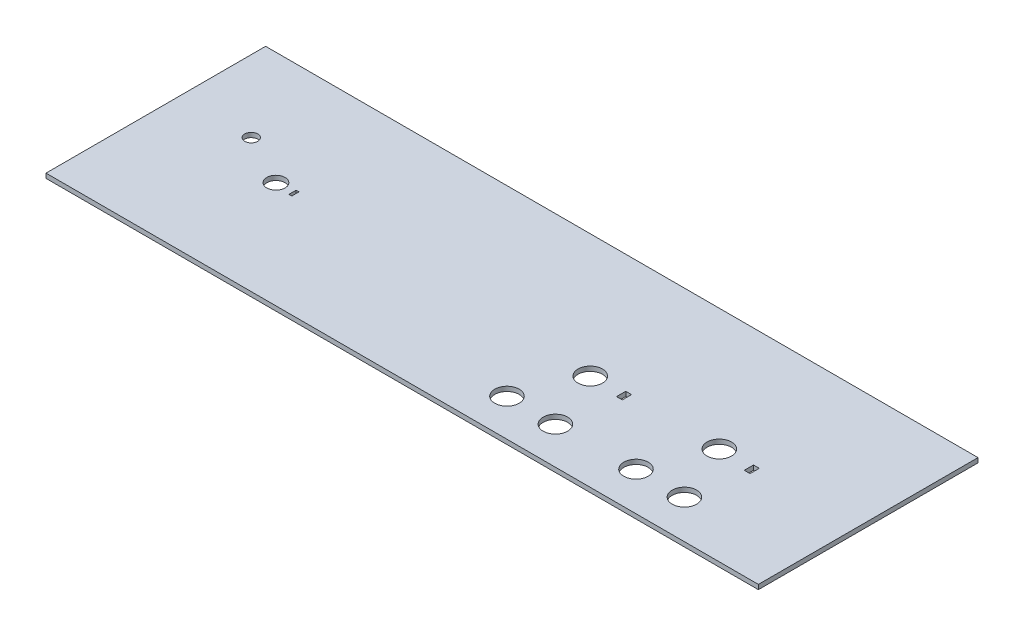
ISO-10303-21;
HEADER;
FILE_DESCRIPTION(('STEP AP214'),'2;1');
FILE_NAME('part.step','',(''),(''),'','','');
FILE_SCHEMA(('AUTOMOTIVE_DESIGN { 1 0 10303 214 1 1 1 1 }'));
ENDSEC;
DATA;
#1=APPLICATION_CONTEXT('core data for automotive mechanical design processes');
#2=APPLICATION_PROTOCOL_DEFINITION('international standard','automotive_design',2000,#1);
#3=PRODUCT_CONTEXT('',#1,'mechanical');
#4=PRODUCT('Part','Part','',(#3));
#5=PRODUCT_RELATED_PRODUCT_CATEGORY('part','',(#4));
#6=PRODUCT_DEFINITION_FORMATION('','',#4);
#7=PRODUCT_DEFINITION_CONTEXT('part definition',#1,'design');
#8=PRODUCT_DEFINITION('design','',#6,#7);
#9=PRODUCT_DEFINITION_SHAPE('','',#8);
#10=(LENGTH_UNIT() NAMED_UNIT(*) SI_UNIT(.MILLI.,.METRE.));
#11=(NAMED_UNIT(*) PLANE_ANGLE_UNIT() SI_UNIT($,.RADIAN.));
#12=(NAMED_UNIT(*) SI_UNIT($,.STERADIAN.) SOLID_ANGLE_UNIT());
#13=UNCERTAINTY_MEASURE_WITH_UNIT(LENGTH_MEASURE(1.E-05),#10,'distance_accuracy_value','');
#14=(GEOMETRIC_REPRESENTATION_CONTEXT(3) GLOBAL_UNCERTAINTY_ASSIGNED_CONTEXT((#13)) GLOBAL_UNIT_ASSIGNED_CONTEXT((#10,
#11,#12)) REPRESENTATION_CONTEXT('',''));
#15=CARTESIAN_POINT('',(0.,0.,0.));
#16=DIRECTION('',(0.,0.,1.));
#17=DIRECTION('',(1.,0.,0.));
#18=AXIS2_PLACEMENT_3D('',#15,#16,#17);
#19=CARTESIAN_POINT('',(0.,1.6,0.));
#20=DIRECTION('',(0.,-1.,0.));
#21=DIRECTION('',(0.,0.,-1.));
#22=AXIS2_PLACEMENT_3D('',#19,#20,#21);
#23=PLANE('',#22);
#24=CARTESIAN_POINT('',(42.8531598360651,1.6,-37.0757650903164));
#25=DIRECTION('',(0.,1.,0.));
#26=DIRECTION('',(0.,0.,1.));
#27=AXIS2_PLACEMENT_3D('',#24,#25,#26);
#28=CIRCLE('',#27,3.175);
#29=CARTESIAN_POINT('',(42.8531598360651,1.6,-33.9007650903164));
#30=VERTEX_POINT('',#29);
#31=EDGE_CURVE('E182',#30,#30,#28,.T.);
#32=ORIENTED_EDGE('',*,*,#31,.F.);
#33=EDGE_LOOP('',(#32));
#34=FACE_BOUND('',#33,.T.);
#35=DIRECTION('',(0.,0.,-1.));
#36=VECTOR('',#35,1.);
#37=CARTESIAN_POINT('',(168.455253876297,1.6,-31.8967419398398));
#38=LINE('',#37,#36);
#39=CARTESIAN_POINT('',(168.455253876297,1.6,-31.8967419398398));
#40=VERTEX_POINT('',#39);
#41=CARTESIAN_POINT('',(168.455253876297,1.6,-35.0967419398398));
#42=VERTEX_POINT('',#41);
#43=EDGE_CURVE('E194',#40,#42,#38,.T.);
#44=ORIENTED_EDGE('',*,*,#43,.F.);
#45=DIRECTION('',(1.,0.,0.));
#46=VECTOR('',#45,1.);
#47=CARTESIAN_POINT('',(166.455253876297,1.6,-31.8967419398398));
#48=LINE('',#47,#46);
#49=CARTESIAN_POINT('',(166.455253876297,1.6,-31.8967419398398));
#50=VERTEX_POINT('',#49);
#51=EDGE_CURVE('E202',#50,#40,#48,.T.);
#52=ORIENTED_EDGE('',*,*,#51,.F.);
#53=DIRECTION('',(0.,0.,1.));
#54=VECTOR('',#53,1.);
#55=CARTESIAN_POINT('',(166.455253876297,1.6,-31.8967419398398));
#56=LINE('',#55,#54);
#57=CARTESIAN_POINT('',(166.455253876297,1.6,-35.0967419398398));
#58=VERTEX_POINT('',#57);
#59=EDGE_CURVE('E199',#58,#50,#56,.T.);
#60=ORIENTED_EDGE('',*,*,#59,.F.);
#61=DIRECTION('',(-1.,0.,0.));
#62=VECTOR('',#61,1.);
#63=CARTESIAN_POINT('',(166.455253876297,1.6,-35.0967419398398));
#64=LINE('',#63,#62);
#65=EDGE_CURVE('E196',#42,#58,#64,.T.);
#66=ORIENTED_EDGE('',*,*,#65,.F.);
#67=EDGE_LOOP('',(#44,#52,#60,#66));
#68=FACE_BOUND('',#67,.T.);
#69=CARTESIAN_POINT('',(155.705253876297,1.6,-33.4967419398398));
#70=DIRECTION('',(0.,1.,0.));
#71=DIRECTION('',(0.,0.,1.));
#72=AXIS2_PLACEMENT_3D('',#69,#70,#71);
#73=CIRCLE('',#72,4.25000000000001);
#74=CARTESIAN_POINT('',(155.705253876297,1.6,-29.2467419398398));
#75=VERTEX_POINT('',#74);
#76=EDGE_CURVE('E256',#75,#75,#73,.T.);
#77=ORIENTED_EDGE('',*,*,#76,.F.);
#78=EDGE_LOOP('',(#77));
#79=FACE_BOUND('',#78,.T.);
#80=CARTESIAN_POINT('',(147.291503876297,1.6,-12.9682474610587));
#81=DIRECTION('',(0.,1.,0.));
#82=DIRECTION('',(0.,0.,1.));
#83=AXIS2_PLACEMENT_3D('',#80,#81,#82);
#84=CIRCLE('',#83,4.25000000000001);
#85=CARTESIAN_POINT('',(147.291503876297,1.6,-8.71824746105873));
#86=VERTEX_POINT('',#85);
#87=EDGE_CURVE('E268',#86,#86,#84,.T.);
#88=ORIENTED_EDGE('',*,*,#87,.F.);
#89=EDGE_LOOP('',(#88));
#90=FACE_BOUND('',#89,.T.);
#91=CARTESIAN_POINT('',(191.691308657808,1.6,-13.4166431342976));
#92=DIRECTION('',(0.,1.,0.));
#93=DIRECTION('',(0.,0.,1.));
#94=AXIS2_PLACEMENT_3D('',#91,#92,#93);
#95=CIRCLE('',#94,4.25000000000001);
#96=CARTESIAN_POINT('',(191.691308657808,1.6,-9.16664313429763));
#97=VERTEX_POINT('',#96);
#98=EDGE_CURVE('E280',#97,#97,#95,.T.);
#99=ORIENTED_EDGE('',*,*,#98,.F.);
#100=EDGE_LOOP('',(#99));
#101=FACE_BOUND('',#100,.T.);
#102=DIRECTION('',(0.,0.,1.));
#103=VECTOR('',#102,1.);
#104=CARTESIAN_POINT('',(0.,1.6,0.));
#105=LINE('',#104,#103);
#106=CARTESIAN_POINT('',(0.,1.6,-76.3524));
#107=VERTEX_POINT('',#106);
#108=CARTESIAN_POINT('',(0.,1.6,0.));
#109=VERTEX_POINT('',#108);
#110=EDGE_CURVE('E292',#107,#109,#105,.T.);
#111=ORIENTED_EDGE('',*,*,#110,.T.);
#112=DIRECTION('',(1.,0.,0.));
#113=VECTOR('',#112,1.);
#114=CARTESIAN_POINT('',(0.,1.6,0.));
#115=LINE('',#114,#113);
#116=CARTESIAN_POINT('',(247.65,1.6,0.));
#117=VERTEX_POINT('',#116);
#118=EDGE_CURVE('E295',#109,#117,#115,.T.);
#119=ORIENTED_EDGE('',*,*,#118,.T.);
#120=DIRECTION('',(0.,0.,-1.));
#121=VECTOR('',#120,1.);
#122=CARTESIAN_POINT('',(247.65,1.6,0.));
#123=LINE('',#122,#121);
#124=CARTESIAN_POINT('',(247.65,1.6,-76.3524));
#125=VERTEX_POINT('',#124);
#126=EDGE_CURVE('E298',#117,#125,#123,.T.);
#127=ORIENTED_EDGE('',*,*,#126,.T.);
#128=DIRECTION('',(-1.,0.,0.));
#129=VECTOR('',#128,1.);
#130=CARTESIAN_POINT('',(0.,1.6,-76.3524));
#131=LINE('',#130,#129);
#132=EDGE_CURVE('E300',#125,#107,#131,.T.);
#133=ORIENTED_EDGE('',*,*,#132,.T.);
#134=EDGE_LOOP('',(#111,#119,#127,#133));
#135=FACE_BOUND('',#134,.T.);
#136=CARTESIAN_POINT('',(208.518808657808,1.6,-13.4166431342976));
#137=DIRECTION('',(0.,1.,0.));
#138=DIRECTION('',(0.,0.,1.));
#139=AXIS2_PLACEMENT_3D('',#136,#137,#138);
#140=CIRCLE('',#139,4.25000000000001);
#141=CARTESIAN_POINT('',(208.518808657808,1.6,-9.16664313429763));
#142=VERTEX_POINT('',#141);
#143=EDGE_CURVE('E286',#142,#142,#140,.T.);
#144=ORIENTED_EDGE('',*,*,#143,.F.);
#145=EDGE_LOOP('',(#144));
#146=FACE_BOUND('',#145,.T.);
#147=CARTESIAN_POINT('',(164.119003876297,1.6,-12.9682474610587));
#148=DIRECTION('',(0.,1.,0.));
#149=DIRECTION('',(0.,0.,1.));
#150=AXIS2_PLACEMENT_3D('',#147,#148,#149);
#151=CIRCLE('',#150,4.25000000000001);
#152=CARTESIAN_POINT('',(164.119003876297,1.6,-8.71824746105873));
#153=VERTEX_POINT('',#152);
#154=EDGE_CURVE('E274',#153,#153,#151,.T.);
#155=ORIENTED_EDGE('',*,*,#154,.F.);
#156=EDGE_LOOP('',(#155));
#157=FACE_BOUND('',#156,.T.);
#158=CARTESIAN_POINT('',(200.105058657808,1.6,-33.9632743694735));
#159=DIRECTION('',(0.,1.,0.));
#160=DIRECTION('',(0.,0.,1.));
#161=AXIS2_PLACEMENT_3D('',#158,#159,#160);
#162=CIRCLE('',#161,4.25000000000001);
#163=CARTESIAN_POINT('',(200.105058657808,1.6,-29.7132743694734));
#164=VERTEX_POINT('',#163);
#165=EDGE_CURVE('E262',#164,#164,#162,.T.);
#166=ORIENTED_EDGE('',*,*,#165,.F.);
#167=EDGE_LOOP('',(#166));
#168=FACE_BOUND('',#167,.T.);
#169=DIRECTION('',(0.,0.,-1.));
#170=VECTOR('',#169,1.);
#171=CARTESIAN_POINT('',(212.855058657808,1.6,-31.8967419398398));
#172=LINE('',#171,#170);
#173=CARTESIAN_POINT('',(212.855058657808,1.6,-31.8967419398398));
#174=VERTEX_POINT('',#173);
#175=CARTESIAN_POINT('',(212.855058657808,1.6,-35.0967419398398));
#176=VERTEX_POINT('',#175);
#177=EDGE_CURVE('E225',#174,#176,#172,.T.);
#178=ORIENTED_EDGE('',*,*,#177,.F.);
#179=DIRECTION('',(1.,0.,0.));
#180=VECTOR('',#179,1.);
#181=CARTESIAN_POINT('',(210.855058657808,1.6,-31.8967419398398));
#182=LINE('',#181,#180);
#183=CARTESIAN_POINT('',(210.855058657808,1.6,-31.8967419398398));
#184=VERTEX_POINT('',#183);
#185=EDGE_CURVE('E233',#184,#174,#182,.T.);
#186=ORIENTED_EDGE('',*,*,#185,.F.);
#187=DIRECTION('',(0.,0.,1.));
#188=VECTOR('',#187,1.);
#189=CARTESIAN_POINT('',(210.855058657808,1.6,-31.8967419398398));
#190=LINE('',#189,#188);
#191=CARTESIAN_POINT('',(210.855058657808,1.6,-35.0967419398398));
#192=VERTEX_POINT('',#191);
#193=EDGE_CURVE('E230',#192,#184,#190,.T.);
#194=ORIENTED_EDGE('',*,*,#193,.F.);
#195=DIRECTION('',(-1.,0.,0.));
#196=VECTOR('',#195,1.);
#197=CARTESIAN_POINT('',(210.855058657808,1.6,-35.0967419398398));
#198=LINE('',#197,#196);
#199=EDGE_CURVE('E227',#176,#192,#198,.T.);
#200=ORIENTED_EDGE('',*,*,#199,.F.);
#201=EDGE_LOOP('',(#178,#186,#194,#200));
#202=FACE_BOUND('',#201,.T.);
#203=CARTESIAN_POINT('',(25.,1.6,-46.3524));
#204=DIRECTION('',(0.,1.,0.));
#205=DIRECTION('',(0.,0.,1.));
#206=AXIS2_PLACEMENT_3D('',#203,#204,#205);
#207=CIRCLE('',#206,2.25);
#208=CARTESIAN_POINT('',(25.,1.6,-44.1024));
#209=VERTEX_POINT('',#208);
#210=EDGE_CURVE('E188',#209,#209,#207,.T.);
#211=ORIENTED_EDGE('',*,*,#210,.F.);
#212=EDGE_LOOP('',(#211));
#213=FACE_BOUND('',#212,.T.);
#214=DIRECTION('',(0.,0.,-1.));
#215=VECTOR('',#214,1.);
#216=CARTESIAN_POINT('',(49.6281598360651,1.6,-35.8257650903164));
#217=LINE('',#216,#215);
#218=CARTESIAN_POINT('',(49.6281598360651,1.6,-35.8257650903164));
#219=VERTEX_POINT('',#218);
#220=CARTESIAN_POINT('',(49.6281598360651,1.6,-38.3257650903164));
#221=VERTEX_POINT('',#220);
#222=EDGE_CURVE('E146',#219,#221,#217,.T.);
#223=ORIENTED_EDGE('',*,*,#222,.F.);
#224=DIRECTION('',(1.,0.,0.));
#225=VECTOR('',#224,1.);
#226=CARTESIAN_POINT('',(48.6281598360651,1.6,-35.8257650903164));
#227=LINE('',#226,#225);
#228=CARTESIAN_POINT('',(48.6281598360651,1.6,-35.8257650903164));
#229=VERTEX_POINT('',#228);
#230=EDGE_CURVE('E168',#229,#219,#227,.T.);
#231=ORIENTED_EDGE('',*,*,#230,.F.);
#232=DIRECTION('',(0.,0.,1.));
#233=VECTOR('',#232,1.);
#234=CARTESIAN_POINT('',(48.6281598360651,1.6,-35.8257650903164));
#235=LINE('',#234,#233);
#236=CARTESIAN_POINT('',(48.6281598360651,1.6,-38.3257650903164));
#237=VERTEX_POINT('',#236);
#238=EDGE_CURVE('E166',#237,#229,#235,.T.);
#239=ORIENTED_EDGE('',*,*,#238,.F.);
#240=DIRECTION('',(-1.,0.,0.));
#241=VECTOR('',#240,1.);
#242=CARTESIAN_POINT('',(48.6281598360651,1.6,-38.3257650903164));
#243=LINE('',#242,#241);
#244=EDGE_CURVE('E154',#221,#237,#243,.T.);
#245=ORIENTED_EDGE('',*,*,#244,.F.);
#246=EDGE_LOOP('',(#223,#231,#239,#245));
#247=FACE_BOUND('',#246,.T.);
#248=ADVANCED_FACE('F33',(#34,#68,#79,#90,#101,#135,#146,#157,#168,#202,#213,#247),#23,.F.);
#249=CARTESIAN_POINT('',(0.,0.,0.));
#250=DIRECTION('',(0.,-1.,0.));
#251=DIRECTION('',(0.,0.,-1.));
#252=AXIS2_PLACEMENT_3D('',#249,#250,#251);
#253=PLANE('',#252);
#254=CARTESIAN_POINT('',(42.8531598360651,0.,-37.0757650903164));
#255=DIRECTION('',(0.,1.,0.));
#256=DIRECTION('',(0.,0.,1.));
#257=AXIS2_PLACEMENT_3D('',#254,#255,#256);
#258=CIRCLE('',#257,3.175);
#259=CARTESIAN_POINT('',(42.8531598360651,0.,-33.9007650903164));
#260=VERTEX_POINT('',#259);
#261=EDGE_CURVE('E162',#260,#260,#258,.T.);
#262=ORIENTED_EDGE('',*,*,#261,.T.);
#263=EDGE_LOOP('',(#262));
#264=FACE_BOUND('',#263,.T.);
#265=DIRECTION('',(1.,0.,0.));
#266=VECTOR('',#265,1.);
#267=CARTESIAN_POINT('',(166.455253876297,0.,-31.8967419398398));
#268=LINE('',#267,#266);
#269=CARTESIAN_POINT('',(166.455253876297,0.,-31.8967419398398));
#270=VERTEX_POINT('',#269);
#271=CARTESIAN_POINT('',(168.455253876297,0.,-31.8967419398398));
#272=VERTEX_POINT('',#271);
#273=EDGE_CURVE('E197',#270,#272,#268,.T.);
#274=ORIENTED_EDGE('',*,*,#273,.T.);
#275=DIRECTION('',(0.,0.,-1.));
#276=VECTOR('',#275,1.);
#277=CARTESIAN_POINT('',(168.455253876297,0.,-31.8967419398398));
#278=LINE('',#277,#276);
#279=CARTESIAN_POINT('',(168.455253876297,0.,-35.0967419398398));
#280=VERTEX_POINT('',#279);
#281=EDGE_CURVE('E191',#272,#280,#278,.T.);
#282=ORIENTED_EDGE('',*,*,#281,.T.);
#283=DIRECTION('',(-1.,0.,0.));
#284=VECTOR('',#283,1.);
#285=CARTESIAN_POINT('',(166.455253876297,0.,-35.0967419398398));
#286=LINE('',#285,#284);
#287=CARTESIAN_POINT('',(166.455253876297,0.,-35.0967419398398));
#288=VERTEX_POINT('',#287);
#289=EDGE_CURVE('E207',#280,#288,#286,.T.);
#290=ORIENTED_EDGE('',*,*,#289,.T.);
#291=DIRECTION('',(0.,0.,1.));
#292=VECTOR('',#291,1.);
#293=CARTESIAN_POINT('',(166.455253876297,0.,-31.8967419398398));
#294=LINE('',#293,#292);
#295=EDGE_CURVE('E210',#288,#270,#294,.T.);
#296=ORIENTED_EDGE('',*,*,#295,.T.);
#297=EDGE_LOOP('',(#274,#282,#290,#296));
#298=FACE_BOUND('',#297,.T.);
#299=CARTESIAN_POINT('',(155.705253876297,0.,-33.4967419398398));
#300=DIRECTION('',(0.,1.,0.));
#301=DIRECTION('',(0.,0.,1.));
#302=AXIS2_PLACEMENT_3D('',#299,#300,#301);
#303=CIRCLE('',#302,4.25000000000001);
#304=CARTESIAN_POINT('',(155.705253876297,0.,-29.2467419398398));
#305=VERTEX_POINT('',#304);
#306=EDGE_CURVE('E255',#305,#305,#303,.T.);
#307=ORIENTED_EDGE('',*,*,#306,.T.);
#308=EDGE_LOOP('',(#307));
#309=FACE_BOUND('',#308,.T.);
#310=CARTESIAN_POINT('',(147.291503876297,0.,-12.9682474610587));
#311=DIRECTION('',(0.,1.,0.));
#312=DIRECTION('',(0.,0.,1.));
#313=AXIS2_PLACEMENT_3D('',#310,#311,#312);
#314=CIRCLE('',#313,4.25000000000001);
#315=CARTESIAN_POINT('',(147.291503876297,0.,-8.71824746105873));
#316=VERTEX_POINT('',#315);
#317=EDGE_CURVE('E265',#316,#316,#314,.T.);
#318=ORIENTED_EDGE('',*,*,#317,.T.);
#319=EDGE_LOOP('',(#318));
#320=FACE_BOUND('',#319,.T.);
#321=CARTESIAN_POINT('',(191.691308657808,0.,-13.4166431342976));
#322=DIRECTION('',(0.,1.,0.));
#323=DIRECTION('',(0.,0.,1.));
#324=AXIS2_PLACEMENT_3D('',#321,#322,#323);
#325=CIRCLE('',#324,4.25000000000001);
#326=CARTESIAN_POINT('',(191.691308657808,0.,-9.16664313429763));
#327=VERTEX_POINT('',#326);
#328=EDGE_CURVE('E277',#327,#327,#325,.T.);
#329=ORIENTED_EDGE('',*,*,#328,.T.);
#330=EDGE_LOOP('',(#329));
#331=FACE_BOUND('',#330,.T.);
#332=DIRECTION('',(0.,0.,1.));
#333=VECTOR('',#332,1.);
#334=CARTESIAN_POINT('',(0.,0.,0.));
#335=LINE('',#334,#333);
#336=CARTESIAN_POINT('',(0.,0.,-76.3524));
#337=VERTEX_POINT('',#336);
#338=CARTESIAN_POINT('',(0.,0.,0.));
#339=VERTEX_POINT('',#338);
#340=EDGE_CURVE('E289',#337,#339,#335,.T.);
#341=ORIENTED_EDGE('',*,*,#340,.F.);
#342=DIRECTION('',(-1.,0.,0.));
#343=VECTOR('',#342,1.);
#344=CARTESIAN_POINT('',(0.,0.,-76.3524));
#345=LINE('',#344,#343);
#346=CARTESIAN_POINT('',(247.65,0.,-76.3524));
#347=VERTEX_POINT('',#346);
#348=EDGE_CURVE('E296',#347,#337,#345,.T.);
#349=ORIENTED_EDGE('',*,*,#348,.F.);
#350=DIRECTION('',(0.,0.,-1.));
#351=VECTOR('',#350,1.);
#352=CARTESIAN_POINT('',(247.65,0.,0.));
#353=LINE('',#352,#351);
#354=CARTESIAN_POINT('',(247.65,0.,0.));
#355=VERTEX_POINT('',#354);
#356=EDGE_CURVE('E307',#355,#347,#353,.T.);
#357=ORIENTED_EDGE('',*,*,#356,.F.);
#358=DIRECTION('',(1.,0.,0.));
#359=VECTOR('',#358,1.);
#360=CARTESIAN_POINT('',(0.,0.,0.));
#361=LINE('',#360,#359);
#362=EDGE_CURVE('E305',#339,#355,#361,.T.);
#363=ORIENTED_EDGE('',*,*,#362,.F.);
#364=EDGE_LOOP('',(#341,#349,#357,#363));
#365=FACE_BOUND('',#364,.T.);
#366=CARTESIAN_POINT('',(208.518808657808,0.,-13.4166431342976));
#367=DIRECTION('',(0.,1.,0.));
#368=DIRECTION('',(0.,0.,1.));
#369=AXIS2_PLACEMENT_3D('',#366,#367,#368);
#370=CIRCLE('',#369,4.25000000000001);
#371=CARTESIAN_POINT('',(208.518808657808,0.,-9.16664313429763));
#372=VERTEX_POINT('',#371);
#373=EDGE_CURVE('E283',#372,#372,#370,.T.);
#374=ORIENTED_EDGE('',*,*,#373,.T.);
#375=EDGE_LOOP('',(#374));
#376=FACE_BOUND('',#375,.T.);
#377=CARTESIAN_POINT('',(164.119003876297,0.,-12.9682474610587));
#378=DIRECTION('',(0.,1.,0.));
#379=DIRECTION('',(0.,0.,1.));
#380=AXIS2_PLACEMENT_3D('',#377,#378,#379);
#381=CIRCLE('',#380,4.25000000000001);
#382=CARTESIAN_POINT('',(164.119003876297,0.,-8.71824746105873));
#383=VERTEX_POINT('',#382);
#384=EDGE_CURVE('E271',#383,#383,#381,.T.);
#385=ORIENTED_EDGE('',*,*,#384,.T.);
#386=EDGE_LOOP('',(#385));
#387=FACE_BOUND('',#386,.T.);
#388=CARTESIAN_POINT('',(200.105058657808,0.,-33.9632743694735));
#389=DIRECTION('',(0.,1.,0.));
#390=DIRECTION('',(0.,0.,1.));
#391=AXIS2_PLACEMENT_3D('',#388,#389,#390);
#392=CIRCLE('',#391,4.25000000000001);
#393=CARTESIAN_POINT('',(200.105058657808,0.,-29.7132743694734));
#394=VERTEX_POINT('',#393);
#395=EDGE_CURVE('E259',#394,#394,#392,.T.);
#396=ORIENTED_EDGE('',*,*,#395,.T.);
#397=EDGE_LOOP('',(#396));
#398=FACE_BOUND('',#397,.T.);
#399=DIRECTION('',(1.,0.,0.));
#400=VECTOR('',#399,1.);
#401=CARTESIAN_POINT('',(210.855058657808,0.,-31.8967419398398));
#402=LINE('',#401,#400);
#403=CARTESIAN_POINT('',(210.855058657808,0.,-31.8967419398398));
#404=VERTEX_POINT('',#403);
#405=CARTESIAN_POINT('',(212.855058657808,0.,-31.8967419398398));
#406=VERTEX_POINT('',#405);
#407=EDGE_CURVE('E228',#404,#406,#402,.T.);
#408=ORIENTED_EDGE('',*,*,#407,.T.);
#409=DIRECTION('',(0.,0.,-1.));
#410=VECTOR('',#409,1.);
#411=CARTESIAN_POINT('',(212.855058657808,0.,-31.8967419398398));
#412=LINE('',#411,#410);
#413=CARTESIAN_POINT('',(212.855058657808,0.,-35.0967419398398));
#414=VERTEX_POINT('',#413);
#415=EDGE_CURVE('E224',#406,#414,#412,.T.);
#416=ORIENTED_EDGE('',*,*,#415,.T.);
#417=DIRECTION('',(-1.,0.,0.));
#418=VECTOR('',#417,1.);
#419=CARTESIAN_POINT('',(210.855058657808,0.,-35.0967419398398));
#420=LINE('',#419,#418);
#421=CARTESIAN_POINT('',(210.855058657808,0.,-35.0967419398398));
#422=VERTEX_POINT('',#421);
#423=EDGE_CURVE('E238',#414,#422,#420,.T.);
#424=ORIENTED_EDGE('',*,*,#423,.T.);
#425=DIRECTION('',(0.,0.,1.));
#426=VECTOR('',#425,1.);
#427=CARTESIAN_POINT('',(210.855058657808,0.,-31.8967419398398));
#428=LINE('',#427,#426);
#429=EDGE_CURVE('E241',#422,#404,#428,.T.);
#430=ORIENTED_EDGE('',*,*,#429,.T.);
#431=EDGE_LOOP('',(#408,#416,#424,#430));
#432=FACE_BOUND('',#431,.T.);
#433=CARTESIAN_POINT('',(25.,0.,-46.3524));
#434=DIRECTION('',(0.,1.,0.));
#435=DIRECTION('',(0.,0.,1.));
#436=AXIS2_PLACEMENT_3D('',#433,#434,#435);
#437=CIRCLE('',#436,2.25);
#438=CARTESIAN_POINT('',(25.,0.,-44.1024));
#439=VERTEX_POINT('',#438);
#440=EDGE_CURVE('E185',#439,#439,#437,.T.);
#441=ORIENTED_EDGE('',*,*,#440,.T.);
#442=EDGE_LOOP('',(#441));
#443=FACE_BOUND('',#442,.T.);
#444=DIRECTION('',(1.,0.,0.));
#445=VECTOR('',#444,1.);
#446=CARTESIAN_POINT('',(48.6281598360651,0.,-35.8257650903164));
#447=LINE('',#446,#445);
#448=CARTESIAN_POINT('',(48.6281598360651,0.,-35.8257650903164));
#449=VERTEX_POINT('',#448);
#450=CARTESIAN_POINT('',(49.6281598360651,0.,-35.8257650903164));
#451=VERTEX_POINT('',#450);
#452=EDGE_CURVE('E155',#449,#451,#447,.T.);
#453=ORIENTED_EDGE('',*,*,#452,.T.);
#454=DIRECTION('',(0.,0.,-1.));
#455=VECTOR('',#454,1.);
#456=CARTESIAN_POINT('',(49.6281598360651,0.,-35.8257650903164));
#457=LINE('',#456,#455);
#458=CARTESIAN_POINT('',(49.6281598360651,0.,-38.3257650903164));
#459=VERTEX_POINT('',#458);
#460=EDGE_CURVE('E56',#451,#459,#457,.T.);
#461=ORIENTED_EDGE('',*,*,#460,.T.);
#462=DIRECTION('',(-1.,0.,0.));
#463=VECTOR('',#462,1.);
#464=CARTESIAN_POINT('',(48.6281598360651,0.,-38.3257650903164));
#465=LINE('',#464,#463);
#466=CARTESIAN_POINT('',(48.6281598360651,0.,-38.3257650903164));
#467=VERTEX_POINT('',#466);
#468=EDGE_CURVE('E161',#459,#467,#465,.T.);
#469=ORIENTED_EDGE('',*,*,#468,.T.);
#470=DIRECTION('',(0.,0.,1.));
#471=VECTOR('',#470,1.);
#472=CARTESIAN_POINT('',(48.6281598360651,0.,-35.8257650903164));
#473=LINE('',#472,#471);
#474=EDGE_CURVE('E174',#467,#449,#473,.T.);
#475=ORIENTED_EDGE('',*,*,#474,.T.);
#476=EDGE_LOOP('',(#453,#461,#469,#475));
#477=FACE_BOUND('',#476,.T.);
#478=ADVANCED_FACE('F325',(#264,#298,#309,#320,#331,#365,#376,#387,#398,#432,#443,#477),#253,.T.);
#479=CARTESIAN_POINT('',(0.,1.6,0.));
#480=DIRECTION('',(1.,0.,0.));
#481=DIRECTION('',(0.,0.,-1.));
#482=AXIS2_PLACEMENT_3D('',#479,#480,#481);
#483=PLANE('',#482);
#484=ORIENTED_EDGE('',*,*,#340,.T.);
#485=DIRECTION('',(0.,-1.,0.));
#486=VECTOR('',#485,1.);
#487=CARTESIAN_POINT('',(0.,1.6,0.));
#488=LINE('',#487,#486);
#489=EDGE_CURVE('E11',#109,#339,#488,.T.);
#490=ORIENTED_EDGE('',*,*,#489,.F.);
#491=ORIENTED_EDGE('',*,*,#110,.F.);
#492=DIRECTION('',(0.,-1.,0.));
#493=VECTOR('',#492,1.);
#494=CARTESIAN_POINT('',(0.,1.6,-76.3524));
#495=LINE('',#494,#493);
#496=EDGE_CURVE('E302',#107,#337,#495,.T.);
#497=ORIENTED_EDGE('',*,*,#496,.T.);
#498=EDGE_LOOP('',(#484,#490,#491,#497));
#499=FACE_BOUND('',#498,.T.);
#500=ADVANCED_FACE('F35',(#499),#483,.F.);
#501=CARTESIAN_POINT('',(0.,1.6,0.));
#502=DIRECTION('',(0.,0.,-1.));
#503=DIRECTION('',(-1.,0.,0.));
#504=AXIS2_PLACEMENT_3D('',#501,#502,#503);
#505=PLANE('',#504);
#506=ORIENTED_EDGE('',*,*,#362,.T.);
#507=DIRECTION('',(0.,-1.,0.));
#508=VECTOR('',#507,1.);
#509=CARTESIAN_POINT('',(247.65,1.6,0.));
#510=LINE('',#509,#508);
#511=EDGE_CURVE('E41',#117,#355,#510,.T.);
#512=ORIENTED_EDGE('',*,*,#511,.F.);
#513=ORIENTED_EDGE('',*,*,#118,.F.);
#514=ORIENTED_EDGE('',*,*,#489,.T.);
#515=EDGE_LOOP('',(#506,#512,#513,#514));
#516=FACE_BOUND('',#515,.T.);
#517=ADVANCED_FACE('F336',(#516),#505,.F.);
#518=CARTESIAN_POINT('',(247.65,1.6,0.));
#519=DIRECTION('',(-1.,0.,0.));
#520=DIRECTION('',(0.,0.,1.));
#521=AXIS2_PLACEMENT_3D('',#518,#519,#520);
#522=PLANE('',#521);
#523=ORIENTED_EDGE('',*,*,#356,.T.);
#524=DIRECTION('',(0.,-1.,0.));
#525=VECTOR('',#524,1.);
#526=CARTESIAN_POINT('',(247.65,1.6,-76.3524));
#527=LINE('',#526,#525);
#528=EDGE_CURVE('E312',#125,#347,#527,.T.);
#529=ORIENTED_EDGE('',*,*,#528,.F.);
#530=ORIENTED_EDGE('',*,*,#126,.F.);
#531=ORIENTED_EDGE('',*,*,#511,.T.);
#532=EDGE_LOOP('',(#523,#529,#530,#531));
#533=FACE_BOUND('',#532,.T.);
#534=ADVANCED_FACE('F319',(#533),#522,.F.);
#535=CARTESIAN_POINT('',(0.,1.6,-76.3524));
#536=DIRECTION('',(0.,0.,1.));
#537=DIRECTION('',(1.,0.,0.));
#538=AXIS2_PLACEMENT_3D('',#535,#536,#537);
#539=PLANE('',#538);
#540=ORIENTED_EDGE('',*,*,#348,.T.);
#541=ORIENTED_EDGE('',*,*,#496,.F.);
#542=ORIENTED_EDGE('',*,*,#132,.F.);
#543=ORIENTED_EDGE('',*,*,#528,.T.);
#544=EDGE_LOOP('',(#540,#541,#542,#543));
#545=FACE_BOUND('',#544,.T.);
#546=ADVANCED_FACE('F329',(#545),#539,.F.);
#547=CARTESIAN_POINT('',(208.518808657808,1.6,-13.4166431342976));
#548=DIRECTION('',(0.,-1.,0.));
#549=DIRECTION('',(0.,0.,-1.));
#550=AXIS2_PLACEMENT_3D('',#547,#548,#549);
#551=CYLINDRICAL_SURFACE('',#550,4.25000000000001);
#552=ORIENTED_EDGE('',*,*,#143,.T.);
#553=EDGE_LOOP('',(#552));
#554=FACE_BOUND('',#553,.T.);
#555=ORIENTED_EDGE('',*,*,#373,.F.);
#556=EDGE_LOOP('',(#555));
#557=FACE_BOUND('',#556,.T.);
#558=ADVANCED_FACE('F354',(#554,#557),#551,.F.);
#559=CARTESIAN_POINT('',(191.691308657808,1.6,-13.4166431342976));
#560=DIRECTION('',(0.,-1.,0.));
#561=DIRECTION('',(0.,0.,-1.));
#562=AXIS2_PLACEMENT_3D('',#559,#560,#561);
#563=CYLINDRICAL_SURFACE('',#562,4.25000000000001);
#564=ORIENTED_EDGE('',*,*,#98,.T.);
#565=EDGE_LOOP('',(#564));
#566=FACE_BOUND('',#565,.T.);
#567=ORIENTED_EDGE('',*,*,#328,.F.);
#568=EDGE_LOOP('',(#567));
#569=FACE_BOUND('',#568,.T.);
#570=ADVANCED_FACE('F361',(#566,#569),#563,.F.);
#571=CARTESIAN_POINT('',(164.119003876297,1.6,-12.9682474610587));
#572=DIRECTION('',(0.,-1.,0.));
#573=DIRECTION('',(0.,0.,-1.));
#574=AXIS2_PLACEMENT_3D('',#571,#572,#573);
#575=CYLINDRICAL_SURFACE('',#574,4.25000000000001);
#576=ORIENTED_EDGE('',*,*,#154,.T.);
#577=EDGE_LOOP('',(#576));
#578=FACE_BOUND('',#577,.T.);
#579=ORIENTED_EDGE('',*,*,#384,.F.);
#580=EDGE_LOOP('',(#579));
#581=FACE_BOUND('',#580,.T.);
#582=ADVANCED_FACE('F366',(#578,#581),#575,.F.);
#583=CARTESIAN_POINT('',(147.291503876297,1.6,-12.9682474610587));
#584=DIRECTION('',(0.,-1.,0.));
#585=DIRECTION('',(0.,0.,-1.));
#586=AXIS2_PLACEMENT_3D('',#583,#584,#585);
#587=CYLINDRICAL_SURFACE('',#586,4.25000000000001);
#588=ORIENTED_EDGE('',*,*,#87,.T.);
#589=EDGE_LOOP('',(#588));
#590=FACE_BOUND('',#589,.T.);
#591=ORIENTED_EDGE('',*,*,#317,.F.);
#592=EDGE_LOOP('',(#591));
#593=FACE_BOUND('',#592,.T.);
#594=ADVANCED_FACE('F442',(#590,#593),#587,.F.);
#595=CARTESIAN_POINT('',(200.105058657808,1.6,-33.9632743694735));
#596=DIRECTION('',(0.,-1.,0.));
#597=DIRECTION('',(0.,0.,-1.));
#598=AXIS2_PLACEMENT_3D('',#595,#596,#597);
#599=CYLINDRICAL_SURFACE('',#598,4.25000000000001);
#600=ORIENTED_EDGE('',*,*,#165,.T.);
#601=EDGE_LOOP('',(#600));
#602=FACE_BOUND('',#601,.T.);
#603=ORIENTED_EDGE('',*,*,#395,.F.);
#604=EDGE_LOOP('',(#603));
#605=FACE_BOUND('',#604,.T.);
#606=ADVANCED_FACE('F438',(#602,#605),#599,.F.);
#607=CARTESIAN_POINT('',(155.705253876297,1.6,-33.4967419398398));
#608=DIRECTION('',(0.,-1.,0.));
#609=DIRECTION('',(0.,0.,-1.));
#610=AXIS2_PLACEMENT_3D('',#607,#608,#609);
#611=CYLINDRICAL_SURFACE('',#610,4.25000000000001);
#612=ORIENTED_EDGE('',*,*,#76,.T.);
#613=EDGE_LOOP('',(#612));
#614=FACE_BOUND('',#613,.T.);
#615=ORIENTED_EDGE('',*,*,#306,.F.);
#616=EDGE_LOOP('',(#615));
#617=FACE_BOUND('',#616,.T.);
#618=ADVANCED_FACE('F434',(#614,#617),#611,.F.);
#619=CARTESIAN_POINT('',(212.855058657808,1.6,-31.8967419398398));
#620=DIRECTION('',(-1.,0.,0.));
#621=DIRECTION('',(0.,0.,1.));
#622=AXIS2_PLACEMENT_3D('',#619,#620,#621);
#623=PLANE('',#622);
#624=ORIENTED_EDGE('',*,*,#415,.F.);
#625=DIRECTION('',(0.,-1.,0.));
#626=VECTOR('',#625,1.);
#627=CARTESIAN_POINT('',(212.855058657808,1.6,-31.8967419398398));
#628=LINE('',#627,#626);
#629=EDGE_CURVE('E235',#174,#406,#628,.T.);
#630=ORIENTED_EDGE('',*,*,#629,.F.);
#631=ORIENTED_EDGE('',*,*,#177,.T.);
#632=DIRECTION('',(0.,-1.,0.));
#633=VECTOR('',#632,1.);
#634=CARTESIAN_POINT('',(212.855058657808,1.6,-35.0967419398398));
#635=LINE('',#634,#633);
#636=EDGE_CURVE('E252',#176,#414,#635,.T.);
#637=ORIENTED_EDGE('',*,*,#636,.T.);
#638=EDGE_LOOP('',(#624,#630,#631,#637));
#639=FACE_BOUND('',#638,.T.);
#640=ADVANCED_FACE('F430',(#639),#623,.T.);
#641=CARTESIAN_POINT('',(210.855058657808,1.6,-35.0967419398398));
#642=DIRECTION('',(0.,0.,1.));
#643=DIRECTION('',(1.,0.,0.));
#644=AXIS2_PLACEMENT_3D('',#641,#642,#643);
#645=PLANE('',#644);
#646=ORIENTED_EDGE('',*,*,#423,.F.);
#647=ORIENTED_EDGE('',*,*,#636,.F.);
#648=ORIENTED_EDGE('',*,*,#199,.T.);
#649=DIRECTION('',(0.,-1.,0.));
#650=VECTOR('',#649,1.);
#651=CARTESIAN_POINT('',(210.855058657808,1.6,-35.0967419398398));
#652=LINE('',#651,#650);
#653=EDGE_CURVE('E250',#192,#422,#652,.T.);
#654=ORIENTED_EDGE('',*,*,#653,.T.);
#655=EDGE_LOOP('',(#646,#647,#648,#654));
#656=FACE_BOUND('',#655,.T.);
#657=ADVANCED_FACE('F426',(#656),#645,.T.);
#658=CARTESIAN_POINT('',(210.855058657808,1.6,-31.8967419398398));
#659=DIRECTION('',(1.,0.,0.));
#660=DIRECTION('',(0.,0.,-1.));
#661=AXIS2_PLACEMENT_3D('',#658,#659,#660);
#662=PLANE('',#661);
#663=ORIENTED_EDGE('',*,*,#429,.F.);
#664=ORIENTED_EDGE('',*,*,#653,.F.);
#665=ORIENTED_EDGE('',*,*,#193,.T.);
#666=DIRECTION('',(0.,-1.,0.));
#667=VECTOR('',#666,1.);
#668=CARTESIAN_POINT('',(210.855058657808,1.6,-31.8967419398398));
#669=LINE('',#668,#667);
#670=EDGE_CURVE('E248',#184,#404,#669,.T.);
#671=ORIENTED_EDGE('',*,*,#670,.T.);
#672=EDGE_LOOP('',(#663,#664,#665,#671));
#673=FACE_BOUND('',#672,.T.);
#674=ADVANCED_FACE('F422',(#673),#662,.T.);
#675=CARTESIAN_POINT('',(210.855058657808,1.6,-31.8967419398398));
#676=DIRECTION('',(0.,0.,-1.));
#677=DIRECTION('',(-1.,0.,0.));
#678=AXIS2_PLACEMENT_3D('',#675,#676,#677);
#679=PLANE('',#678);
#680=ORIENTED_EDGE('',*,*,#407,.F.);
#681=ORIENTED_EDGE('',*,*,#670,.F.);
#682=ORIENTED_EDGE('',*,*,#185,.T.);
#683=ORIENTED_EDGE('',*,*,#629,.T.);
#684=EDGE_LOOP('',(#680,#681,#682,#683));
#685=FACE_BOUND('',#684,.T.);
#686=ADVANCED_FACE('F418',(#685),#679,.T.);
#687=CARTESIAN_POINT('',(168.455253876297,1.6,-31.8967419398398));
#688=DIRECTION('',(-1.,0.,0.));
#689=DIRECTION('',(0.,0.,1.));
#690=AXIS2_PLACEMENT_3D('',#687,#688,#689);
#691=PLANE('',#690);
#692=ORIENTED_EDGE('',*,*,#281,.F.);
#693=DIRECTION('',(0.,-1.,0.));
#694=VECTOR('',#693,1.);
#695=CARTESIAN_POINT('',(168.455253876297,1.6,-31.8967419398398));
#696=LINE('',#695,#694);
#697=EDGE_CURVE('E204',#40,#272,#696,.T.);
#698=ORIENTED_EDGE('',*,*,#697,.F.);
#699=ORIENTED_EDGE('',*,*,#43,.T.);
#700=DIRECTION('',(0.,-1.,0.));
#701=VECTOR('',#700,1.);
#702=CARTESIAN_POINT('',(168.455253876297,1.6,-35.0967419398398));
#703=LINE('',#702,#701);
#704=EDGE_CURVE('E221',#42,#280,#703,.T.);
#705=ORIENTED_EDGE('',*,*,#704,.T.);
#706=EDGE_LOOP('',(#692,#698,#699,#705));
#707=FACE_BOUND('',#706,.T.);
#708=ADVANCED_FACE('F414',(#707),#691,.T.);
#709=CARTESIAN_POINT('',(166.455253876297,1.6,-35.0967419398398));
#710=DIRECTION('',(0.,0.,1.));
#711=DIRECTION('',(1.,0.,0.));
#712=AXIS2_PLACEMENT_3D('',#709,#710,#711);
#713=PLANE('',#712);
#714=ORIENTED_EDGE('',*,*,#289,.F.);
#715=ORIENTED_EDGE('',*,*,#704,.F.);
#716=ORIENTED_EDGE('',*,*,#65,.T.);
#717=DIRECTION('',(0.,-1.,0.));
#718=VECTOR('',#717,1.);
#719=CARTESIAN_POINT('',(166.455253876297,1.6,-35.0967419398398));
#720=LINE('',#719,#718);
#721=EDGE_CURVE('E219',#58,#288,#720,.T.);
#722=ORIENTED_EDGE('',*,*,#721,.T.);
#723=EDGE_LOOP('',(#714,#715,#716,#722));
#724=FACE_BOUND('',#723,.T.);
#725=ADVANCED_FACE('F410',(#724),#713,.T.);
#726=CARTESIAN_POINT('',(166.455253876297,1.6,-31.8967419398398));
#727=DIRECTION('',(1.,0.,0.));
#728=DIRECTION('',(0.,0.,-1.));
#729=AXIS2_PLACEMENT_3D('',#726,#727,#728);
#730=PLANE('',#729);
#731=ORIENTED_EDGE('',*,*,#295,.F.);
#732=ORIENTED_EDGE('',*,*,#721,.F.);
#733=ORIENTED_EDGE('',*,*,#59,.T.);
#734=DIRECTION('',(0.,-1.,0.));
#735=VECTOR('',#734,1.);
#736=CARTESIAN_POINT('',(166.455253876297,1.6,-31.8967419398398));
#737=LINE('',#736,#735);
#738=EDGE_CURVE('E217',#50,#270,#737,.T.);
#739=ORIENTED_EDGE('',*,*,#738,.T.);
#740=EDGE_LOOP('',(#731,#732,#733,#739));
#741=FACE_BOUND('',#740,.T.);
#742=ADVANCED_FACE('F406',(#741),#730,.T.);
#743=CARTESIAN_POINT('',(166.455253876297,1.6,-31.8967419398398));
#744=DIRECTION('',(0.,0.,-1.));
#745=DIRECTION('',(-1.,0.,0.));
#746=AXIS2_PLACEMENT_3D('',#743,#744,#745);
#747=PLANE('',#746);
#748=ORIENTED_EDGE('',*,*,#273,.F.);
#749=ORIENTED_EDGE('',*,*,#738,.F.);
#750=ORIENTED_EDGE('',*,*,#51,.T.);
#751=ORIENTED_EDGE('',*,*,#697,.T.);
#752=EDGE_LOOP('',(#748,#749,#750,#751));
#753=FACE_BOUND('',#752,.T.);
#754=ADVANCED_FACE('F402',(#753),#747,.T.);
#755=CARTESIAN_POINT('',(25.,1.6,-46.3524));
#756=DIRECTION('',(0.,-1.,0.));
#757=DIRECTION('',(0.,0.,-1.));
#758=AXIS2_PLACEMENT_3D('',#755,#756,#757);
#759=CYLINDRICAL_SURFACE('',#758,2.25);
#760=ORIENTED_EDGE('',*,*,#210,.T.);
#761=EDGE_LOOP('',(#760));
#762=FACE_BOUND('',#761,.T.);
#763=ORIENTED_EDGE('',*,*,#440,.F.);
#764=EDGE_LOOP('',(#763));
#765=FACE_BOUND('',#764,.T.);
#766=ADVANCED_FACE('F398',(#762,#765),#759,.F.);
#767=CARTESIAN_POINT('',(42.8531598360651,1.6,-37.0757650903164));
#768=DIRECTION('',(0.,-1.,0.));
#769=DIRECTION('',(0.,0.,-1.));
#770=AXIS2_PLACEMENT_3D('',#767,#768,#769);
#771=CYLINDRICAL_SURFACE('',#770,3.175);
#772=ORIENTED_EDGE('',*,*,#31,.T.);
#773=EDGE_LOOP('',(#772));
#774=FACE_BOUND('',#773,.T.);
#775=ORIENTED_EDGE('',*,*,#261,.F.);
#776=EDGE_LOOP('',(#775));
#777=FACE_BOUND('',#776,.T.);
#778=ADVANCED_FACE('F395',(#774,#777),#771,.F.);
#779=CARTESIAN_POINT('',(49.6281598360651,1.6,-35.8257650903164));
#780=DIRECTION('',(-1.,0.,0.));
#781=DIRECTION('',(0.,0.,1.));
#782=AXIS2_PLACEMENT_3D('',#779,#780,#781);
#783=PLANE('',#782);
#784=ORIENTED_EDGE('',*,*,#460,.F.);
#785=DIRECTION('',(0.,-1.,0.));
#786=VECTOR('',#785,1.);
#787=CARTESIAN_POINT('',(49.6281598360651,1.6,-35.8257650903164));
#788=LINE('',#787,#786);
#789=EDGE_CURVE('E150',#219,#451,#788,.T.);
#790=ORIENTED_EDGE('',*,*,#789,.F.);
#791=ORIENTED_EDGE('',*,*,#222,.T.);
#792=DIRECTION('',(0.,-1.,0.));
#793=VECTOR('',#792,1.);
#794=CARTESIAN_POINT('',(49.6281598360651,1.6,-38.3257650903164));
#795=LINE('',#794,#793);
#796=EDGE_CURVE('E149',#221,#459,#795,.T.);
#797=ORIENTED_EDGE('',*,*,#796,.T.);
#798=EDGE_LOOP('',(#784,#790,#791,#797));
#799=FACE_BOUND('',#798,.T.);
#800=ADVANCED_FACE('F148',(#799),#783,.T.);
#801=CARTESIAN_POINT('',(48.6281598360651,1.6,-38.3257650903164));
#802=DIRECTION('',(0.,0.,1.));
#803=DIRECTION('',(1.,0.,0.));
#804=AXIS2_PLACEMENT_3D('',#801,#802,#803);
#805=PLANE('',#804);
#806=ORIENTED_EDGE('',*,*,#468,.F.);
#807=ORIENTED_EDGE('',*,*,#796,.F.);
#808=ORIENTED_EDGE('',*,*,#244,.T.);
#809=DIRECTION('',(0.,-1.,0.));
#810=VECTOR('',#809,1.);
#811=CARTESIAN_POINT('',(48.6281598360651,1.6,-38.3257650903164));
#812=LINE('',#811,#810);
#813=EDGE_CURVE('E163',#237,#467,#812,.T.);
#814=ORIENTED_EDGE('',*,*,#813,.T.);
#815=EDGE_LOOP('',(#806,#807,#808,#814));
#816=FACE_BOUND('',#815,.T.);
#817=ADVANCED_FACE('F158',(#816),#805,.T.);
#818=CARTESIAN_POINT('',(48.6281598360651,1.6,-35.8257650903164));
#819=DIRECTION('',(1.,0.,0.));
#820=DIRECTION('',(0.,0.,-1.));
#821=AXIS2_PLACEMENT_3D('',#818,#819,#820);
#822=PLANE('',#821);
#823=ORIENTED_EDGE('',*,*,#474,.F.);
#824=ORIENTED_EDGE('',*,*,#813,.F.);
#825=ORIENTED_EDGE('',*,*,#238,.T.);
#826=DIRECTION('',(0.,-1.,0.));
#827=VECTOR('',#826,1.);
#828=CARTESIAN_POINT('',(48.6281598360651,1.6,-35.8257650903164));
#829=LINE('',#828,#827);
#830=EDGE_CURVE('E48',#229,#449,#829,.T.);
#831=ORIENTED_EDGE('',*,*,#830,.T.);
#832=EDGE_LOOP('',(#823,#824,#825,#831));
#833=FACE_BOUND('',#832,.T.);
#834=ADVANCED_FACE('F383',(#833),#822,.T.);
#835=CARTESIAN_POINT('',(48.6281598360651,1.6,-35.8257650903164));
#836=DIRECTION('',(0.,0.,-1.));
#837=DIRECTION('',(-1.,0.,0.));
#838=AXIS2_PLACEMENT_3D('',#835,#836,#837);
#839=PLANE('',#838);
#840=ORIENTED_EDGE('',*,*,#452,.F.);
#841=ORIENTED_EDGE('',*,*,#830,.F.);
#842=ORIENTED_EDGE('',*,*,#230,.T.);
#843=ORIENTED_EDGE('',*,*,#789,.T.);
#844=EDGE_LOOP('',(#840,#841,#842,#843));
#845=FACE_BOUND('',#844,.T.);
#846=ADVANCED_FACE('F381',(#845),#839,.T.);
#847=CLOSED_SHELL('',(#248,#478,#500,#517,#534,#546,#558,#570,#582,#594,#606,#618,#640,#657,
#674,#686,#708,#725,#742,#754,#766,#778,#800,#817,#834,#846));
#848=MANIFOLD_SOLID_BREP('B2',#847);
#849=ADVANCED_BREP_SHAPE_REPRESENTATION('',(#18,#848),#14);
#850=SHAPE_DEFINITION_REPRESENTATION(#9,#849);
ENDSEC;
END-ISO-10303-21;
